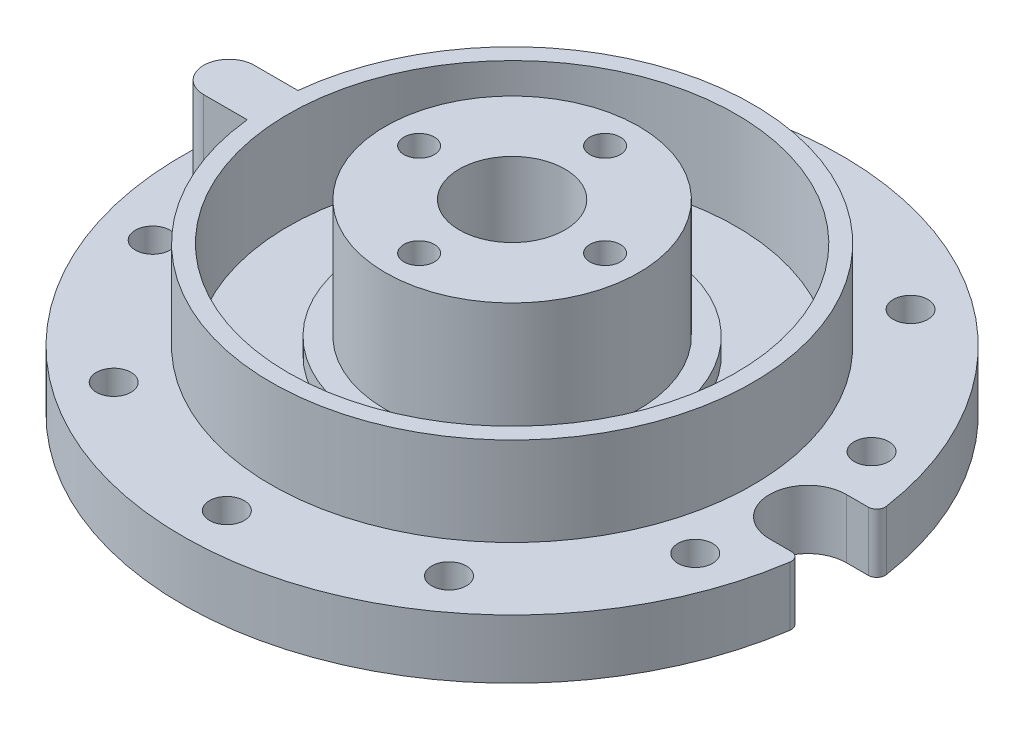
ISO-10303-21;
HEADER;
FILE_DESCRIPTION(('STEP AP214'),'2;1');
FILE_NAME('part.step','',(''),(''),'','','');
FILE_SCHEMA(('AUTOMOTIVE_DESIGN { 1 0 10303 214 1 1 1 1 }'));
ENDSEC;
DATA;
#1=APPLICATION_CONTEXT('core data for automotive mechanical design processes');
#2=APPLICATION_PROTOCOL_DEFINITION('international standard','automotive_design',2000,#1);
#3=PRODUCT_CONTEXT('',#1,'mechanical');
#4=PRODUCT('Part','Part','',(#3));
#5=PRODUCT_RELATED_PRODUCT_CATEGORY('part','',(#4));
#6=PRODUCT_DEFINITION_FORMATION('','',#4);
#7=PRODUCT_DEFINITION_CONTEXT('part definition',#1,'design');
#8=PRODUCT_DEFINITION('design','',#6,#7);
#9=PRODUCT_DEFINITION_SHAPE('','',#8);
#10=(LENGTH_UNIT() NAMED_UNIT(*) SI_UNIT(.MILLI.,.METRE.));
#11=(NAMED_UNIT(*) PLANE_ANGLE_UNIT() SI_UNIT($,.RADIAN.));
#12=(NAMED_UNIT(*) SI_UNIT($,.STERADIAN.) SOLID_ANGLE_UNIT());
#13=UNCERTAINTY_MEASURE_WITH_UNIT(LENGTH_MEASURE(1.E-05),#10,'distance_accuracy_value','');
#14=(GEOMETRIC_REPRESENTATION_CONTEXT(3) GLOBAL_UNCERTAINTY_ASSIGNED_CONTEXT((#13)) GLOBAL_UNIT_ASSIGNED_CONTEXT((#10,
#11,#12)) REPRESENTATION_CONTEXT('',''));
#15=CARTESIAN_POINT('',(0.,0.,0.));
#16=DIRECTION('',(0.,0.,1.));
#17=DIRECTION('',(1.,0.,0.));
#18=AXIS2_PLACEMENT_3D('',#15,#16,#17);
#19=CARTESIAN_POINT('',(0.,7.,0.));
#20=DIRECTION('',(0.,1.,0.));
#21=DIRECTION('',(0.,0.,1.));
#22=AXIS2_PLACEMENT_3D('',#19,#20,#21);
#23=PLANE('',#22);
#24=CARTESIAN_POINT('',(0.,7.,-33.75));
#25=DIRECTION('',(0.,1.,0.));
#26=DIRECTION('',(0.,0.,1.));
#27=AXIS2_PLACEMENT_3D('',#24,#25,#26);
#28=CIRCLE('',#27,2.05);
#29=CARTESIAN_POINT('',(0.,7.,-31.7));
#30=VERTEX_POINT('',#29);
#31=EDGE_CURVE('E168',#30,#30,#28,.T.);
#32=ORIENTED_EDGE('',*,*,#31,.F.);
#33=EDGE_LOOP('',(#32));
#34=FACE_BOUND('',#33,.T.);
#35=CARTESIAN_POINT('',(-19.8377522648707,7.,-27.3043235601536));
#36=DIRECTION('',(0.,1.,0.));
#37=DIRECTION('',(0.,0.,1.));
#38=AXIS2_PLACEMENT_3D('',#35,#36,#37);
#39=CIRCLE('',#38,2.05000000000094);
#40=CARTESIAN_POINT('',(-19.8377522648707,7.,-25.2543235601527));
#41=VERTEX_POINT('',#40);
#42=EDGE_CURVE('E153',#41,#41,#39,.T.);
#43=ORIENTED_EDGE('',*,*,#42,.F.);
#44=EDGE_LOOP('',(#43));
#45=FACE_BOUND('',#44,.T.);
#46=CARTESIAN_POINT('',(-32.0981574249604,7.,-10.4293235601531));
#47=DIRECTION('',(0.,1.,0.));
#48=DIRECTION('',(0.,0.,1.));
#49=AXIS2_PLACEMENT_3D('',#46,#47,#48);
#50=CIRCLE('',#49,2.05000000000172);
#51=CARTESIAN_POINT('',(-32.0981574249604,7.,-8.37932356015139));
#52=VERTEX_POINT('',#51);
#53=EDGE_CURVE('E175',#52,#52,#50,.T.);
#54=ORIENTED_EDGE('',*,*,#53,.F.);
#55=EDGE_LOOP('',(#54));
#56=FACE_BOUND('',#55,.T.);
#57=CARTESIAN_POINT('',(-32.0981574249596,7.,10.4293235601558));
#58=DIRECTION('',(0.,1.,0.));
#59=DIRECTION('',(0.,0.,1.));
#60=AXIS2_PLACEMENT_3D('',#57,#58,#59);
#61=CIRCLE('',#60,2.0500000000025);
#62=CARTESIAN_POINT('',(-32.0981574249596,7.,12.4793235601583));
#63=VERTEX_POINT('',#62);
#64=EDGE_CURVE('E216',#63,#63,#61,.T.);
#65=ORIENTED_EDGE('',*,*,#64,.F.);
#66=EDGE_LOOP('',(#65));
#67=FACE_BOUND('',#66,.T.);
#68=CARTESIAN_POINT('',(-19.8377522648684,7.,27.3043235601553));
#69=DIRECTION('',(0.,1.,0.));
#70=DIRECTION('',(0.,0.,1.));
#71=AXIS2_PLACEMENT_3D('',#68,#69,#70);
#72=CIRCLE('',#71,2.050000000003);
#73=CARTESIAN_POINT('',(-19.8377522648684,7.,29.3543235601583));
#74=VERTEX_POINT('',#73);
#75=EDGE_CURVE('E210',#74,#74,#72,.T.);
#76=ORIENTED_EDGE('',*,*,#75,.F.);
#77=EDGE_LOOP('',(#76));
#78=FACE_BOUND('',#77,.T.);
#79=CARTESIAN_POINT('',(2.86529853098704E-12,7.,33.75));
#80=DIRECTION('',(0.,1.,0.));
#81=DIRECTION('',(0.,0.,1.));
#82=AXIS2_PLACEMENT_3D('',#79,#80,#81);
#83=CIRCLE('',#82,2.05000000000297);
#84=CARTESIAN_POINT('',(2.86529853098704E-12,7.,35.800000000003));
#85=VERTEX_POINT('',#84);
#86=EDGE_CURVE('E204',#85,#85,#83,.T.);
#87=ORIENTED_EDGE('',*,*,#86,.F.);
#88=EDGE_LOOP('',(#87));
#89=FACE_BOUND('',#88,.T.);
#90=CARTESIAN_POINT('',(19.8377522648736,7.,27.3043235601536));
#91=DIRECTION('',(0.,1.,0.));
#92=DIRECTION('',(0.,0.,1.));
#93=AXIS2_PLACEMENT_3D('',#90,#91,#92);
#94=CIRCLE('',#93,2.05000000000241);
#95=CARTESIAN_POINT('',(19.8377522648736,7.,29.354323560156));
#96=VERTEX_POINT('',#95);
#97=EDGE_CURVE('E198',#96,#96,#94,.T.);
#98=ORIENTED_EDGE('',*,*,#97,.F.);
#99=EDGE_LOOP('',(#98));
#100=FACE_BOUND('',#99,.T.);
#101=CARTESIAN_POINT('',(32.0981574249633,7.,10.4293235601531));
#102=DIRECTION('',(0.,1.,0.));
#103=DIRECTION('',(0.,0.,1.));
#104=AXIS2_PLACEMENT_3D('',#101,#102,#103);
#105=CIRCLE('',#104,2.05000000000154);
#106=CARTESIAN_POINT('',(32.0981574249633,7.,12.4793235601547));
#107=VERTEX_POINT('',#106);
#108=EDGE_CURVE('E192',#107,#107,#105,.T.);
#109=ORIENTED_EDGE('',*,*,#108,.F.);
#110=EDGE_LOOP('',(#109));
#111=FACE_BOUND('',#110,.T.);
#112=CARTESIAN_POINT('',(32.0981574249624,7.,-10.4293235601558));
#113=DIRECTION('',(0.,1.,0.));
#114=DIRECTION('',(0.,0.,1.));
#115=AXIS2_PLACEMENT_3D('',#112,#113,#114);
#116=CIRCLE('',#115,2.05000000000065);
#117=CARTESIAN_POINT('',(32.0981574249624,7.,-8.37932356015519));
#118=VERTEX_POINT('',#117);
#119=EDGE_CURVE('E186',#118,#118,#116,.T.);
#120=ORIENTED_EDGE('',*,*,#119,.F.);
#121=EDGE_LOOP('',(#120));
#122=FACE_BOUND('',#121,.T.);
#123=CARTESIAN_POINT('',(19.8377522648712,7.,-27.3043235601553));
#124=DIRECTION('',(0.,1.,0.));
#125=DIRECTION('',(0.,0.,1.));
#126=AXIS2_PLACEMENT_3D('',#123,#124,#125);
#127=CIRCLE('',#126,2.05000000000006);
#128=CARTESIAN_POINT('',(19.8377522648712,7.,-25.2543235601553));
#129=VERTEX_POINT('',#128);
#130=EDGE_CURVE('E180',#129,#129,#127,.T.);
#131=ORIENTED_EDGE('',*,*,#130,.F.);
#132=EDGE_LOOP('',(#131));
#133=FACE_BOUND('',#132,.T.);
#134=CARTESIAN_POINT('',(0.,7.,0.));
#135=DIRECTION('',(0.,1.,0.));
#136=DIRECTION('',(0.,0.,1.));
#137=AXIS2_PLACEMENT_3D('',#134,#135,#136);
#138=CIRCLE('',#137,28.5);
#139=CARTESIAN_POINT('',(-28.3416654415368,7.,2.99999999999999));
#140=VERTEX_POINT('',#139);
#141=CARTESIAN_POINT('',(-28.3416654415368,7.,-3.));
#142=VERTEX_POINT('',#141);
#143=EDGE_CURVE('E232',#140,#142,#138,.T.);
#144=ORIENTED_EDGE('',*,*,#143,.F.);
#145=DIRECTION('',(1.,0.,0.));
#146=VECTOR('',#145,1.);
#147=CARTESIAN_POINT('',(-33.5,7.,3.));
#148=LINE('',#147,#146);
#149=CARTESIAN_POINT('',(-33.5,7.,3.));
#150=VERTEX_POINT('',#149);
#151=EDGE_CURVE('E144',#150,#140,#148,.T.);
#152=ORIENTED_EDGE('',*,*,#151,.F.);
#153=CARTESIAN_POINT('',(-33.5,7.,0.));
#154=DIRECTION('',(0.,1.,0.));
#155=DIRECTION('',(0.,0.,1.));
#156=AXIS2_PLACEMENT_3D('',#153,#154,#155);
#157=CIRCLE('',#156,3.);
#158=CARTESIAN_POINT('',(-33.5,7.,-3.));
#159=VERTEX_POINT('',#158);
#160=EDGE_CURVE('E148',#159,#150,#157,.T.);
#161=ORIENTED_EDGE('',*,*,#160,.F.);
#162=DIRECTION('',(-1.,0.,0.));
#163=VECTOR('',#162,1.);
#164=CARTESIAN_POINT('',(-33.5,7.,-3.));
#165=LINE('',#164,#163);
#166=EDGE_CURVE('E139',#142,#159,#165,.T.);
#167=ORIENTED_EDGE('',*,*,#166,.F.);
#168=EDGE_LOOP('',(#144,#152,#161,#167));
#169=FACE_BOUND('',#168,.T.);
#170=CARTESIAN_POINT('',(0.,7.,0.));
#171=DIRECTION('',(0.,1.,0.));
#172=DIRECTION('',(0.,0.,1.));
#173=AXIS2_PLACEMENT_3D('',#170,#171,#172);
#174=CIRCLE('',#173,39.);
#175=CARTESIAN_POINT('',(38.5817960237504,7.,-5.69605263157895));
#176=VERTEX_POINT('',#175);
#177=CARTESIAN_POINT('',(38.5817960237504,7.,5.69605263157895));
#178=VERTEX_POINT('',#177);
#179=EDGE_CURVE('E282',#176,#178,#174,.T.);
#180=ORIENTED_EDGE('',*,*,#179,.T.);
#181=CARTESIAN_POINT('',(37.5925192026286,7.,5.55));
#182=DIRECTION('',(0.,1.,0.));
#183=DIRECTION('',(0.,0.,1.));
#184=AXIS2_PLACEMENT_3D('',#181,#182,#183);
#185=CIRCLE('',#184,1.);
#186=CARTESIAN_POINT('',(37.5925192026286,7.,4.55));
#187=VERTEX_POINT('',#186);
#188=EDGE_CURVE('E302',#178,#187,#185,.T.);
#189=ORIENTED_EDGE('',*,*,#188,.T.);
#190=DIRECTION('',(1.,0.,0.));
#191=VECTOR('',#190,1.);
#192=CARTESIAN_POINT('',(35.,7.,4.55));
#193=LINE('',#192,#191);
#194=CARTESIAN_POINT('',(35.,7.,4.55));
#195=VERTEX_POINT('',#194);
#196=EDGE_CURVE('E131',#195,#187,#193,.T.);
#197=ORIENTED_EDGE('',*,*,#196,.F.);
#198=CARTESIAN_POINT('',(35.,7.,0.));
#199=DIRECTION('',(0.,1.,0.));
#200=DIRECTION('',(0.,0.,1.));
#201=AXIS2_PLACEMENT_3D('',#198,#199,#200);
#202=CIRCLE('',#201,4.55);
#203=CARTESIAN_POINT('',(35.,7.,-4.55));
#204=VERTEX_POINT('',#203);
#205=EDGE_CURVE('E118',#204,#195,#202,.T.);
#206=ORIENTED_EDGE('',*,*,#205,.F.);
#207=DIRECTION('',(1.,0.,0.));
#208=VECTOR('',#207,1.);
#209=CARTESIAN_POINT('',(35.,7.,-4.55));
#210=LINE('',#209,#208);
#211=CARTESIAN_POINT('',(37.5925192026286,7.,-4.55));
#212=VERTEX_POINT('',#211);
#213=EDGE_CURVE('E128',#204,#212,#210,.T.);
#214=ORIENTED_EDGE('',*,*,#213,.T.);
#215=CARTESIAN_POINT('',(37.5925192026286,7.,-5.55));
#216=DIRECTION('',(0.,1.,0.));
#217=DIRECTION('',(0.,0.,1.));
#218=AXIS2_PLACEMENT_3D('',#215,#216,#217);
#219=CIRCLE('',#218,1.);
#220=EDGE_CURVE('E300',#212,#176,#219,.T.);
#221=ORIENTED_EDGE('',*,*,#220,.T.);
#222=EDGE_LOOP('',(#180,#189,#197,#206,#214,#221));
#223=FACE_BOUND('',#222,.T.);
#224=ADVANCED_FACE('F32',(#34,#45,#56,#67,#78,#89,#100,#111,#122,#133,#169,#223),#23,.T.);
#225=CARTESIAN_POINT('',(0.,0.,0.));
#226=DIRECTION('',(0.,1.,0.));
#227=DIRECTION('',(0.,0.,1.));
#228=AXIS2_PLACEMENT_3D('',#225,#226,#227);
#229=PLANE('',#228);
#230=CARTESIAN_POINT('',(3.08597469297258E-13,0.,11.));
#231=DIRECTION('',(0.,-1.,0.));
#232=DIRECTION('',(0.,0.,-1.));
#233=AXIS2_PLACEMENT_3D('',#230,#231,#232);
#234=CIRCLE('',#233,4.55);
#235=CARTESIAN_POINT('',(3.08597469297258E-13,0.,6.45));
#236=VERTEX_POINT('',#235);
#237=EDGE_CURVE('E252',#236,#236,#234,.T.);
#238=ORIENTED_EDGE('',*,*,#237,.F.);
#239=EDGE_LOOP('',(#238));
#240=FACE_BOUND('',#239,.T.);
#241=CARTESIAN_POINT('',(0.,0.,0.));
#242=DIRECTION('',(0.,1.,0.));
#243=DIRECTION('',(0.,0.,1.));
#244=AXIS2_PLACEMENT_3D('',#241,#242,#243);
#245=CIRCLE('',#244,6.25);
#246=CARTESIAN_POINT('',(0.,0.,6.25));
#247=VERTEX_POINT('',#246);
#248=EDGE_CURVE('E269',#247,#247,#245,.T.);
#249=ORIENTED_EDGE('',*,*,#248,.T.);
#250=EDGE_LOOP('',(#249));
#251=FACE_BOUND('',#250,.T.);
#252=CARTESIAN_POINT('',(-10.9999999999998,0.,1.55645846127691E-13));
#253=DIRECTION('',(0.,-1.,0.));
#254=DIRECTION('',(0.,0.,-1.));
#255=AXIS2_PLACEMENT_3D('',#252,#253,#254);
#256=CIRCLE('',#255,4.55);
#257=CARTESIAN_POINT('',(-10.9999999999998,0.,-4.54999999999985));
#258=VERTEX_POINT('',#257);
#259=EDGE_CURVE('E248',#258,#258,#256,.T.);
#260=ORIENTED_EDGE('',*,*,#259,.F.);
#261=EDGE_LOOP('',(#260));
#262=FACE_BOUND('',#261,.T.);
#263=CARTESIAN_POINT('',(0.,0.,-11.));
#264=DIRECTION('',(0.,-1.,0.));
#265=DIRECTION('',(0.,0.,-1.));
#266=AXIS2_PLACEMENT_3D('',#263,#264,#265);
#267=CIRCLE('',#266,4.55);
#268=CARTESIAN_POINT('',(0.,0.,-15.55));
#269=VERTEX_POINT('',#268);
#270=EDGE_CURVE('E242',#269,#269,#267,.T.);
#271=ORIENTED_EDGE('',*,*,#270,.F.);
#272=EDGE_LOOP('',(#271));
#273=FACE_BOUND('',#272,.T.);
#274=CARTESIAN_POINT('',(11.,0.,0.));
#275=DIRECTION('',(0.,-1.,0.));
#276=DIRECTION('',(0.,0.,-1.));
#277=AXIS2_PLACEMENT_3D('',#274,#275,#276);
#278=CIRCLE('',#277,4.55);
#279=CARTESIAN_POINT('',(11.,0.,-4.54999999999996));
#280=VERTEX_POINT('',#279);
#281=EDGE_CURVE('E236',#280,#280,#278,.T.);
#282=ORIENTED_EDGE('',*,*,#281,.F.);
#283=EDGE_LOOP('',(#282));
#284=FACE_BOUND('',#283,.T.);
#285=CARTESIAN_POINT('',(19.8377522648712,0.,-27.3043235601553));
#286=DIRECTION('',(0.,1.,0.));
#287=DIRECTION('',(0.,0.,1.));
#288=AXIS2_PLACEMENT_3D('',#285,#286,#287);
#289=CIRCLE('',#288,2.05000000000006);
#290=CARTESIAN_POINT('',(19.8377522648712,0.,-25.2543235601553));
#291=VERTEX_POINT('',#290);
#292=EDGE_CURVE('E171',#291,#291,#289,.T.);
#293=ORIENTED_EDGE('',*,*,#292,.T.);
#294=EDGE_LOOP('',(#293));
#295=FACE_BOUND('',#294,.T.);
#296=CARTESIAN_POINT('',(32.0981574249624,0.,-10.4293235601558));
#297=DIRECTION('',(0.,1.,0.));
#298=DIRECTION('',(0.,0.,1.));
#299=AXIS2_PLACEMENT_3D('',#296,#297,#298);
#300=CIRCLE('',#299,2.05000000000065);
#301=CARTESIAN_POINT('',(32.0981574249624,0.,-8.37932356015519));
#302=VERTEX_POINT('',#301);
#303=EDGE_CURVE('E183',#302,#302,#300,.T.);
#304=ORIENTED_EDGE('',*,*,#303,.T.);
#305=EDGE_LOOP('',(#304));
#306=FACE_BOUND('',#305,.T.);
#307=CARTESIAN_POINT('',(32.0981574249633,0.,10.4293235601531));
#308=DIRECTION('',(0.,1.,0.));
#309=DIRECTION('',(0.,0.,1.));
#310=AXIS2_PLACEMENT_3D('',#307,#308,#309);
#311=CIRCLE('',#310,2.05000000000154);
#312=CARTESIAN_POINT('',(32.0981574249633,0.,12.4793235601547));
#313=VERTEX_POINT('',#312);
#314=EDGE_CURVE('E189',#313,#313,#311,.T.);
#315=ORIENTED_EDGE('',*,*,#314,.T.);
#316=EDGE_LOOP('',(#315));
#317=FACE_BOUND('',#316,.T.);
#318=CARTESIAN_POINT('',(19.8377522648736,0.,27.3043235601536));
#319=DIRECTION('',(0.,1.,0.));
#320=DIRECTION('',(0.,0.,1.));
#321=AXIS2_PLACEMENT_3D('',#318,#319,#320);
#322=CIRCLE('',#321,2.05000000000241);
#323=CARTESIAN_POINT('',(19.8377522648736,0.,29.354323560156));
#324=VERTEX_POINT('',#323);
#325=EDGE_CURVE('E195',#324,#324,#322,.T.);
#326=ORIENTED_EDGE('',*,*,#325,.T.);
#327=EDGE_LOOP('',(#326));
#328=FACE_BOUND('',#327,.T.);
#329=CARTESIAN_POINT('',(2.86529853098704E-12,0.,33.75));
#330=DIRECTION('',(0.,1.,0.));
#331=DIRECTION('',(0.,0.,1.));
#332=AXIS2_PLACEMENT_3D('',#329,#330,#331);
#333=CIRCLE('',#332,2.05000000000297);
#334=CARTESIAN_POINT('',(2.86529853098704E-12,0.,35.800000000003));
#335=VERTEX_POINT('',#334);
#336=EDGE_CURVE('E201',#335,#335,#333,.T.);
#337=ORIENTED_EDGE('',*,*,#336,.T.);
#338=EDGE_LOOP('',(#337));
#339=FACE_BOUND('',#338,.T.);
#340=CARTESIAN_POINT('',(-19.8377522648684,0.,27.3043235601553));
#341=DIRECTION('',(0.,1.,0.));
#342=DIRECTION('',(0.,0.,1.));
#343=AXIS2_PLACEMENT_3D('',#340,#341,#342);
#344=CIRCLE('',#343,2.050000000003);
#345=CARTESIAN_POINT('',(-19.8377522648684,0.,29.3543235601583));
#346=VERTEX_POINT('',#345);
#347=EDGE_CURVE('E207',#346,#346,#344,.T.);
#348=ORIENTED_EDGE('',*,*,#347,.T.);
#349=EDGE_LOOP('',(#348));
#350=FACE_BOUND('',#349,.T.);
#351=CARTESIAN_POINT('',(-32.0981574249596,0.,10.4293235601558));
#352=DIRECTION('',(0.,1.,0.));
#353=DIRECTION('',(0.,0.,1.));
#354=AXIS2_PLACEMENT_3D('',#351,#352,#353);
#355=CIRCLE('',#354,2.0500000000025);
#356=CARTESIAN_POINT('',(-32.0981574249596,0.,12.4793235601583));
#357=VERTEX_POINT('',#356);
#358=EDGE_CURVE('E213',#357,#357,#355,.T.);
#359=ORIENTED_EDGE('',*,*,#358,.T.);
#360=EDGE_LOOP('',(#359));
#361=FACE_BOUND('',#360,.T.);
#362=CARTESIAN_POINT('',(-32.0981574249604,0.,-10.4293235601531));
#363=DIRECTION('',(0.,1.,0.));
#364=DIRECTION('',(0.,0.,1.));
#365=AXIS2_PLACEMENT_3D('',#362,#363,#364);
#366=CIRCLE('',#365,2.05000000000172);
#367=CARTESIAN_POINT('',(-32.0981574249604,0.,-8.37932356015139));
#368=VERTEX_POINT('',#367);
#369=EDGE_CURVE('E219',#368,#368,#366,.T.);
#370=ORIENTED_EDGE('',*,*,#369,.T.);
#371=EDGE_LOOP('',(#370));
#372=FACE_BOUND('',#371,.T.);
#373=CARTESIAN_POINT('',(-19.8377522648707,0.,-27.3043235601536));
#374=DIRECTION('',(0.,1.,0.));
#375=DIRECTION('',(0.,0.,1.));
#376=AXIS2_PLACEMENT_3D('',#373,#374,#375);
#377=CIRCLE('',#376,2.05000000000094);
#378=CARTESIAN_POINT('',(-19.8377522648707,0.,-25.2543235601527));
#379=VERTEX_POINT('',#378);
#380=EDGE_CURVE('E172',#379,#379,#377,.T.);
#381=ORIENTED_EDGE('',*,*,#380,.T.);
#382=EDGE_LOOP('',(#381));
#383=FACE_BOUND('',#382,.T.);
#384=CARTESIAN_POINT('',(0.,0.,-33.75));
#385=DIRECTION('',(0.,1.,0.));
#386=DIRECTION('',(0.,0.,1.));
#387=AXIS2_PLACEMENT_3D('',#384,#385,#386);
#388=CIRCLE('',#387,2.05);
#389=CARTESIAN_POINT('',(0.,0.,-31.7));
#390=VERTEX_POINT('',#389);
#391=EDGE_CURVE('E164',#390,#390,#388,.T.);
#392=ORIENTED_EDGE('',*,*,#391,.T.);
#393=EDGE_LOOP('',(#392));
#394=FACE_BOUND('',#393,.T.);
#395=DIRECTION('',(1.,0.,0.));
#396=VECTOR('',#395,1.);
#397=CARTESIAN_POINT('',(35.,0.,4.55));
#398=LINE('',#397,#396);
#399=CARTESIAN_POINT('',(35.,0.,4.55));
#400=VERTEX_POINT('',#399);
#401=CARTESIAN_POINT('',(37.5925192026286,0.,4.55));
#402=VERTEX_POINT('',#401);
#403=EDGE_CURVE('E123',#400,#402,#398,.T.);
#404=ORIENTED_EDGE('',*,*,#403,.T.);
#405=CARTESIAN_POINT('',(37.5925192026286,0.,5.55));
#406=DIRECTION('',(0.,1.,0.));
#407=DIRECTION('',(0.,0.,1.));
#408=AXIS2_PLACEMENT_3D('',#405,#406,#407);
#409=CIRCLE('',#408,1.);
#410=CARTESIAN_POINT('',(38.5817960237504,0.,5.69605263157895));
#411=VERTEX_POINT('',#410);
#412=EDGE_CURVE('E40',#402,#411,#409,.F.);
#413=ORIENTED_EDGE('',*,*,#412,.T.);
#414=CARTESIAN_POINT('',(0.,0.,0.));
#415=DIRECTION('',(0.,1.,0.));
#416=DIRECTION('',(0.,0.,1.));
#417=AXIS2_PLACEMENT_3D('',#414,#415,#416);
#418=CIRCLE('',#417,39.);
#419=CARTESIAN_POINT('',(38.5817960237504,0.,-5.69605263157895));
#420=VERTEX_POINT('',#419);
#421=EDGE_CURVE('E285',#420,#411,#418,.T.);
#422=ORIENTED_EDGE('',*,*,#421,.F.);
#423=CARTESIAN_POINT('',(37.5925192026286,0.,-5.55));
#424=DIRECTION('',(0.,1.,0.));
#425=DIRECTION('',(0.,0.,1.));
#426=AXIS2_PLACEMENT_3D('',#423,#424,#425);
#427=CIRCLE('',#426,1.);
#428=CARTESIAN_POINT('',(37.5925192026286,0.,-4.55));
#429=VERTEX_POINT('',#428);
#430=EDGE_CURVE('E47',#420,#429,#427,.F.);
#431=ORIENTED_EDGE('',*,*,#430,.T.);
#432=DIRECTION('',(1.,0.,0.));
#433=VECTOR('',#432,1.);
#434=CARTESIAN_POINT('',(35.,0.,-4.55));
#435=LINE('',#434,#433);
#436=CARTESIAN_POINT('',(35.,0.,-4.55));
#437=VERTEX_POINT('',#436);
#438=EDGE_CURVE('E121',#437,#429,#435,.T.);
#439=ORIENTED_EDGE('',*,*,#438,.F.);
#440=CARTESIAN_POINT('',(35.,0.,0.));
#441=DIRECTION('',(0.,1.,0.));
#442=DIRECTION('',(0.,0.,1.));
#443=AXIS2_PLACEMENT_3D('',#440,#441,#442);
#444=CIRCLE('',#443,4.55);
#445=EDGE_CURVE('E116',#437,#400,#444,.T.);
#446=ORIENTED_EDGE('',*,*,#445,.T.);
#447=EDGE_LOOP('',(#404,#413,#422,#431,#439,#446));
#448=FACE_BOUND('',#447,.T.);
#449=ADVANCED_FACE('F127',(#240,#251,#262,#273,#284,#295,#306,#317,#328,#339,#350,#361,#372,
#383,#394,#448),#229,.F.);
#450=CARTESIAN_POINT('',(0.,7.,0.));
#451=DIRECTION('',(0.,-1.,0.));
#452=DIRECTION('',(0.,0.,-1.));
#453=AXIS2_PLACEMENT_3D('',#450,#451,#452);
#454=CYLINDRICAL_SURFACE('',#453,39.);
#455=ORIENTED_EDGE('',*,*,#421,.T.);
#456=DIRECTION('',(0.,-1.,0.));
#457=VECTOR('',#456,1.);
#458=CARTESIAN_POINT('',(38.5817960237504,7.,5.69605263157895));
#459=LINE('',#458,#457);
#460=EDGE_CURVE('E297',#411,#178,#459,.F.);
#461=ORIENTED_EDGE('',*,*,#460,.T.);
#462=ORIENTED_EDGE('',*,*,#179,.F.);
#463=DIRECTION('',(0.,-1.,0.));
#464=VECTOR('',#463,1.);
#465=CARTESIAN_POINT('',(38.5817960237504,7.,-5.69605263157895));
#466=LINE('',#465,#464);
#467=EDGE_CURVE('E281',#176,#420,#466,.T.);
#468=ORIENTED_EDGE('',*,*,#467,.T.);
#469=EDGE_LOOP('',(#455,#461,#462,#468));
#470=FACE_BOUND('',#469,.T.);
#471=ADVANCED_FACE('F308',(#470),#454,.T.);
#472=CARTESIAN_POINT('',(0.,17.5,0.));
#473=DIRECTION('',(0.,-1.,0.));
#474=DIRECTION('',(0.,0.,-1.));
#475=AXIS2_PLACEMENT_3D('',#472,#473,#474);
#476=CYLINDRICAL_SURFACE('',#475,28.5);
#477=DIRECTION('',(0.,-1.,0.));
#478=VECTOR('',#477,1.);
#479=CARTESIAN_POINT('',(-28.3416654415368,27.6271132494811,2.99999999999999));
#480=LINE('',#479,#478);
#481=CARTESIAN_POINT('',(-28.3416654415368,17.5,3.));
#482=VERTEX_POINT('',#481);
#483=EDGE_CURVE('E146',#482,#140,#480,.T.);
#484=ORIENTED_EDGE('',*,*,#483,.T.);
#485=ORIENTED_EDGE('',*,*,#143,.T.);
#486=DIRECTION('',(0.,-1.,0.));
#487=VECTOR('',#486,1.);
#488=CARTESIAN_POINT('',(-28.3416654415368,27.6271132494811,-3.));
#489=LINE('',#488,#487);
#490=CARTESIAN_POINT('',(-28.3416654415368,17.5,-3.));
#491=VERTEX_POINT('',#490);
#492=EDGE_CURVE('E143',#491,#142,#489,.T.);
#493=ORIENTED_EDGE('',*,*,#492,.F.);
#494=CARTESIAN_POINT('',(0.,17.5,0.));
#495=DIRECTION('',(0.,1.,0.));
#496=DIRECTION('',(0.,0.,1.));
#497=AXIS2_PLACEMENT_3D('',#494,#495,#496);
#498=CIRCLE('',#497,28.5);
#499=EDGE_CURVE('E233',#482,#491,#498,.T.);
#500=ORIENTED_EDGE('',*,*,#499,.F.);
#501=EDGE_LOOP('',(#484,#485,#493,#500));
#502=FACE_BOUND('',#501,.T.);
#503=ADVANCED_FACE('F342',(#502),#476,.T.);
#504=CARTESIAN_POINT('',(0.,8.,0.));
#505=DIRECTION('',(0.,-1.,0.));
#506=DIRECTION('',(0.,0.,-1.));
#507=AXIS2_PLACEMENT_3D('',#504,#505,#506);
#508=CYLINDRICAL_SURFACE('',#507,17.5);
#509=CARTESIAN_POINT('',(0.,8.,0.));
#510=DIRECTION('',(0.,1.,0.));
#511=DIRECTION('',(0.,0.,1.));
#512=AXIS2_PLACEMENT_3D('',#509,#510,#511);
#513=CIRCLE('',#512,17.5);
#514=CARTESIAN_POINT('',(0.,8.,17.5));
#515=VERTEX_POINT('',#514);
#516=EDGE_CURVE('E277',#515,#515,#513,.T.);
#517=ORIENTED_EDGE('',*,*,#516,.F.);
#518=EDGE_LOOP('',(#517));
#519=FACE_BOUND('',#518,.T.);
#520=CARTESIAN_POINT('',(0.,6.,0.));
#521=DIRECTION('',(0.,1.,0.));
#522=DIRECTION('',(0.,0.,1.));
#523=AXIS2_PLACEMENT_3D('',#520,#521,#522);
#524=CIRCLE('',#523,17.5);
#525=CARTESIAN_POINT('',(0.,6.,17.5));
#526=VERTEX_POINT('',#525);
#527=EDGE_CURVE('E167',#526,#526,#524,.T.);
#528=ORIENTED_EDGE('',*,*,#527,.T.);
#529=EDGE_LOOP('',(#528));
#530=FACE_BOUND('',#529,.T.);
#531=ADVANCED_FACE('F338',(#519,#530),#508,.T.);
#532=CARTESIAN_POINT('',(0.,8.,0.));
#533=DIRECTION('',(0.,1.,0.));
#534=DIRECTION('',(0.,0.,1.));
#535=AXIS2_PLACEMENT_3D('',#532,#533,#534);
#536=PLANE('',#535);
#537=CARTESIAN_POINT('',(0.,8.,0.));
#538=DIRECTION('',(0.,1.,0.));
#539=DIRECTION('',(0.,0.,1.));
#540=AXIS2_PLACEMENT_3D('',#537,#538,#539);
#541=CIRCLE('',#540,15.);
#542=CARTESIAN_POINT('',(0.,8.,15.));
#543=VERTEX_POINT('',#542);
#544=EDGE_CURVE('E278',#543,#543,#541,.T.);
#545=ORIENTED_EDGE('',*,*,#544,.F.);
#546=EDGE_LOOP('',(#545));
#547=FACE_BOUND('',#546,.T.);
#548=ORIENTED_EDGE('',*,*,#516,.T.);
#549=EDGE_LOOP('',(#548));
#550=FACE_BOUND('',#549,.T.);
#551=ADVANCED_FACE('F566',(#547,#550),#536,.T.);
#552=CARTESIAN_POINT('',(0.,22.,0.));
#553=DIRECTION('',(0.,-1.,0.));
#554=DIRECTION('',(0.,0.,-1.));
#555=AXIS2_PLACEMENT_3D('',#552,#553,#554);
#556=CYLINDRICAL_SURFACE('',#555,15.);
#557=CARTESIAN_POINT('',(0.,22.,0.));
#558=DIRECTION('',(0.,1.,0.));
#559=DIRECTION('',(0.,0.,1.));
#560=AXIS2_PLACEMENT_3D('',#557,#558,#559);
#561=CIRCLE('',#560,15.);
#562=CARTESIAN_POINT('',(0.,22.,15.));
#563=VERTEX_POINT('',#562);
#564=EDGE_CURVE('E272',#563,#563,#561,.T.);
#565=ORIENTED_EDGE('',*,*,#564,.F.);
#566=EDGE_LOOP('',(#565));
#567=FACE_BOUND('',#566,.T.);
#568=ORIENTED_EDGE('',*,*,#544,.T.);
#569=EDGE_LOOP('',(#568));
#570=FACE_BOUND('',#569,.T.);
#571=ADVANCED_FACE('F666',(#567,#570),#556,.T.);
#572=CARTESIAN_POINT('',(0.,22.,0.));
#573=DIRECTION('',(0.,1.,0.));
#574=DIRECTION('',(0.,0.,1.));
#575=AXIS2_PLACEMENT_3D('',#572,#573,#574);
#576=PLANE('',#575);
#577=CARTESIAN_POINT('',(0.,22.,-11.));
#578=DIRECTION('',(0.,1.,0.));
#579=DIRECTION('',(0.,0.,1.));
#580=AXIS2_PLACEMENT_3D('',#577,#578,#579);
#581=CIRCLE('',#580,1.8);
#582=CARTESIAN_POINT('',(0.,22.,-9.2));
#583=VERTEX_POINT('',#582);
#584=EDGE_CURVE('E263',#583,#583,#581,.T.);
#585=ORIENTED_EDGE('',*,*,#584,.F.);
#586=EDGE_LOOP('',(#585));
#587=FACE_BOUND('',#586,.T.);
#588=CARTESIAN_POINT('',(11.,22.,0.));
#589=DIRECTION('',(0.,1.,0.));
#590=DIRECTION('',(0.,0.,1.));
#591=AXIS2_PLACEMENT_3D('',#588,#589,#590);
#592=CIRCLE('',#591,1.8);
#593=CARTESIAN_POINT('',(11.,22.,1.80000000000004));
#594=VERTEX_POINT('',#593);
#595=EDGE_CURVE('E259',#594,#594,#592,.T.);
#596=ORIENTED_EDGE('',*,*,#595,.F.);
#597=EDGE_LOOP('',(#596));
#598=FACE_BOUND('',#597,.T.);
#599=CARTESIAN_POINT('',(3.08597469297258E-13,22.,11.));
#600=DIRECTION('',(0.,1.,0.));
#601=DIRECTION('',(0.,0.,1.));
#602=AXIS2_PLACEMENT_3D('',#599,#600,#601);
#603=CIRCLE('',#602,1.8);
#604=CARTESIAN_POINT('',(3.08597469297258E-13,22.,12.8));
#605=VERTEX_POINT('',#604);
#606=EDGE_CURVE('E256',#605,#605,#603,.T.);
#607=ORIENTED_EDGE('',*,*,#606,.F.);
#608=EDGE_LOOP('',(#607));
#609=FACE_BOUND('',#608,.T.);
#610=CARTESIAN_POINT('',(-10.9999999999998,22.,1.55645846127691E-13));
#611=DIRECTION('',(0.,1.,0.));
#612=DIRECTION('',(0.,0.,1.));
#613=AXIS2_PLACEMENT_3D('',#610,#611,#612);
#614=CIRCLE('',#613,1.8);
#615=CARTESIAN_POINT('',(-10.9999999999998,22.,1.80000000000015));
#616=VERTEX_POINT('',#615);
#617=EDGE_CURVE('E260',#616,#616,#614,.T.);
#618=ORIENTED_EDGE('',*,*,#617,.F.);
#619=EDGE_LOOP('',(#618));
#620=FACE_BOUND('',#619,.T.);
#621=CARTESIAN_POINT('',(0.,22.,0.));
#622=DIRECTION('',(0.,1.,0.));
#623=DIRECTION('',(0.,0.,1.));
#624=AXIS2_PLACEMENT_3D('',#621,#622,#623);
#625=CIRCLE('',#624,6.25);
#626=CARTESIAN_POINT('',(0.,22.,6.25));
#627=VERTEX_POINT('',#626);
#628=EDGE_CURVE('E266',#627,#627,#625,.T.);
#629=ORIENTED_EDGE('',*,*,#628,.F.);
#630=EDGE_LOOP('',(#629));
#631=FACE_BOUND('',#630,.T.);
#632=ORIENTED_EDGE('',*,*,#564,.T.);
#633=EDGE_LOOP('',(#632));
#634=FACE_BOUND('',#633,.T.);
#635=ADVANCED_FACE('F656',(#587,#598,#609,#620,#631,#634),#576,.T.);
#636=CARTESIAN_POINT('',(0.,0.,0.));
#637=DIRECTION('',(0.,1.,0.));
#638=DIRECTION('',(0.,0.,1.));
#639=AXIS2_PLACEMENT_3D('',#636,#637,#638);
#640=CYLINDRICAL_SURFACE('',#639,6.25);
#641=ORIENTED_EDGE('',*,*,#248,.F.);
#642=EDGE_LOOP('',(#641));
#643=FACE_BOUND('',#642,.T.);
#644=ORIENTED_EDGE('',*,*,#628,.T.);
#645=EDGE_LOOP('',(#644));
#646=FACE_BOUND('',#645,.T.);
#647=ADVANCED_FACE('F646',(#643,#646),#640,.F.);
#648=CARTESIAN_POINT('',(-10.9999999999998,0.,1.55645846127691E-13));
#649=DIRECTION('',(0.,1.,0.));
#650=DIRECTION('',(0.,0.,1.));
#651=AXIS2_PLACEMENT_3D('',#648,#649,#650);
#652=CYLINDRICAL_SURFACE('',#651,1.8);
#653=CARTESIAN_POINT('',(-10.9999999999998,2.74999999999999,1.55645846127691E-13));
#654=DIRECTION('',(0.,-1.,0.));
#655=DIRECTION('',(0.,0.,-1.));
#656=AXIS2_PLACEMENT_3D('',#653,#654,#655);
#657=CIRCLE('',#656,1.8);
#658=CARTESIAN_POINT('',(-10.9999999999998,2.74999999999999,-1.79999999999984));
#659=VERTEX_POINT('',#658);
#660=EDGE_CURVE('E251',#659,#659,#657,.T.);
#661=ORIENTED_EDGE('',*,*,#660,.T.);
#662=EDGE_LOOP('',(#661));
#663=FACE_BOUND('',#662,.T.);
#664=ORIENTED_EDGE('',*,*,#617,.T.);
#665=EDGE_LOOP('',(#664));
#666=FACE_BOUND('',#665,.T.);
#667=ADVANCED_FACE('F636',(#663,#666),#652,.F.);
#668=CARTESIAN_POINT('',(3.08597469297258E-13,0.,11.));
#669=DIRECTION('',(0.,1.,0.));
#670=DIRECTION('',(0.,0.,1.));
#671=AXIS2_PLACEMENT_3D('',#668,#669,#670);
#672=CYLINDRICAL_SURFACE('',#671,1.8);
#673=CARTESIAN_POINT('',(3.08597469297258E-13,2.74999999999998,11.));
#674=DIRECTION('',(0.,-1.,0.));
#675=DIRECTION('',(0.,0.,-1.));
#676=AXIS2_PLACEMENT_3D('',#673,#674,#675);
#677=CIRCLE('',#676,1.8);
#678=CARTESIAN_POINT('',(3.08597469297258E-13,2.74999999999998,9.2));
#679=VERTEX_POINT('',#678);
#680=EDGE_CURVE('E255',#679,#679,#677,.T.);
#681=ORIENTED_EDGE('',*,*,#680,.T.);
#682=EDGE_LOOP('',(#681));
#683=FACE_BOUND('',#682,.T.);
#684=ORIENTED_EDGE('',*,*,#606,.T.);
#685=EDGE_LOOP('',(#684));
#686=FACE_BOUND('',#685,.T.);
#687=ADVANCED_FACE('F626',(#683,#686),#672,.F.);
#688=CARTESIAN_POINT('',(11.,0.,0.));
#689=DIRECTION('',(0.,1.,0.));
#690=DIRECTION('',(0.,0.,1.));
#691=AXIS2_PLACEMENT_3D('',#688,#689,#690);
#692=CYLINDRICAL_SURFACE('',#691,1.8);
#693=CARTESIAN_POINT('',(11.,2.74999999999999,0.));
#694=DIRECTION('',(0.,-1.,0.));
#695=DIRECTION('',(0.,0.,-1.));
#696=AXIS2_PLACEMENT_3D('',#693,#694,#695);
#697=CIRCLE('',#696,1.8);
#698=CARTESIAN_POINT('',(11.,2.74999999999999,-1.79999999999996));
#699=VERTEX_POINT('',#698);
#700=EDGE_CURVE('E241',#699,#699,#697,.T.);
#701=ORIENTED_EDGE('',*,*,#700,.T.);
#702=EDGE_LOOP('',(#701));
#703=FACE_BOUND('',#702,.T.);
#704=ORIENTED_EDGE('',*,*,#595,.T.);
#705=EDGE_LOOP('',(#704));
#706=FACE_BOUND('',#705,.T.);
#707=ADVANCED_FACE('F616',(#703,#706),#692,.F.);
#708=CARTESIAN_POINT('',(0.,0.,-11.));
#709=DIRECTION('',(0.,1.,0.));
#710=DIRECTION('',(0.,0.,1.));
#711=AXIS2_PLACEMENT_3D('',#708,#709,#710);
#712=CYLINDRICAL_SURFACE('',#711,1.8);
#713=CARTESIAN_POINT('',(0.,2.74999999999998,-11.));
#714=DIRECTION('',(0.,-1.,0.));
#715=DIRECTION('',(0.,0.,-1.));
#716=AXIS2_PLACEMENT_3D('',#713,#714,#715);
#717=CIRCLE('',#716,1.8);
#718=CARTESIAN_POINT('',(0.,2.74999999999998,-12.8));
#719=VERTEX_POINT('',#718);
#720=EDGE_CURVE('E245',#719,#719,#717,.T.);
#721=ORIENTED_EDGE('',*,*,#720,.T.);
#722=EDGE_LOOP('',(#721));
#723=FACE_BOUND('',#722,.T.);
#724=ORIENTED_EDGE('',*,*,#584,.T.);
#725=EDGE_LOOP('',(#724));
#726=FACE_BOUND('',#725,.T.);
#727=ADVANCED_FACE('F606',(#723,#726),#712,.F.);
#728=CARTESIAN_POINT('',(3.08597469297258E-13,0.,11.));
#729=DIRECTION('',(0.,-1.,0.));
#730=DIRECTION('',(0.,0.,-1.));
#731=AXIS2_PLACEMENT_3D('',#728,#729,#730);
#732=CONICAL_SURFACE('',#731,4.55,0.785398163397451);
#733=ORIENTED_EDGE('',*,*,#237,.T.);
#734=EDGE_LOOP('',(#733));
#735=FACE_BOUND('',#734,.T.);
#736=ORIENTED_EDGE('',*,*,#680,.F.);
#737=EDGE_LOOP('',(#736));
#738=FACE_BOUND('',#737,.T.);
#739=ADVANCED_FACE('F596',(#735,#738),#732,.F.);
#740=CARTESIAN_POINT('',(-10.9999999999998,0.,1.55645846127691E-13));
#741=DIRECTION('',(0.,-1.,0.));
#742=DIRECTION('',(0.,0.,-1.));
#743=AXIS2_PLACEMENT_3D('',#740,#741,#742);
#744=CONICAL_SURFACE('',#743,4.55,0.785398163397451);
#745=ORIENTED_EDGE('',*,*,#259,.T.);
#746=EDGE_LOOP('',(#745));
#747=FACE_BOUND('',#746,.T.);
#748=ORIENTED_EDGE('',*,*,#660,.F.);
#749=EDGE_LOOP('',(#748));
#750=FACE_BOUND('',#749,.T.);
#751=ADVANCED_FACE('F586',(#747,#750),#744,.F.);
#752=CARTESIAN_POINT('',(0.,0.,-11.));
#753=DIRECTION('',(0.,-1.,0.));
#754=DIRECTION('',(0.,0.,-1.));
#755=AXIS2_PLACEMENT_3D('',#752,#753,#754);
#756=CONICAL_SURFACE('',#755,4.55,0.785398163397451);
#757=ORIENTED_EDGE('',*,*,#270,.T.);
#758=EDGE_LOOP('',(#757));
#759=FACE_BOUND('',#758,.T.);
#760=ORIENTED_EDGE('',*,*,#720,.F.);
#761=EDGE_LOOP('',(#760));
#762=FACE_BOUND('',#761,.T.);
#763=ADVANCED_FACE('F576',(#759,#762),#756,.F.);
#764=CARTESIAN_POINT('',(11.,0.,0.));
#765=DIRECTION('',(0.,-1.,0.));
#766=DIRECTION('',(0.,0.,-1.));
#767=AXIS2_PLACEMENT_3D('',#764,#765,#766);
#768=CONICAL_SURFACE('',#767,4.55,0.785398163397451);
#769=ORIENTED_EDGE('',*,*,#281,.T.);
#770=EDGE_LOOP('',(#769));
#771=FACE_BOUND('',#770,.T.);
#772=ORIENTED_EDGE('',*,*,#700,.F.);
#773=EDGE_LOOP('',(#772));
#774=FACE_BOUND('',#773,.T.);
#775=ADVANCED_FACE('F428',(#771,#774),#768,.F.);
#776=CARTESIAN_POINT('',(0.,17.5,0.));
#777=DIRECTION('',(0.,1.,0.));
#778=DIRECTION('',(0.,0.,1.));
#779=AXIS2_PLACEMENT_3D('',#776,#777,#778);
#780=PLANE('',#779);
#781=ORIENTED_EDGE('',*,*,#499,.T.);
#782=DIRECTION('',(-1.,0.,0.));
#783=VECTOR('',#782,1.);
#784=CARTESIAN_POINT('',(-33.5,17.5,-3.));
#785=LINE('',#784,#783);
#786=CARTESIAN_POINT('',(-33.5,17.5,-3.));
#787=VERTEX_POINT('',#786);
#788=EDGE_CURVE('E142',#491,#787,#785,.T.);
#789=ORIENTED_EDGE('',*,*,#788,.T.);
#790=CARTESIAN_POINT('',(-33.5,17.5,0.));
#791=DIRECTION('',(0.,1.,0.));
#792=DIRECTION('',(0.,0.,1.));
#793=AXIS2_PLACEMENT_3D('',#790,#791,#792);
#794=CIRCLE('',#793,3.);
#795=CARTESIAN_POINT('',(-33.5,17.5,3.));
#796=VERTEX_POINT('',#795);
#797=EDGE_CURVE('E154',#787,#796,#794,.T.);
#798=ORIENTED_EDGE('',*,*,#797,.T.);
#799=DIRECTION('',(1.,0.,0.));
#800=VECTOR('',#799,1.);
#801=CARTESIAN_POINT('',(-33.5,17.5,3.));
#802=LINE('',#801,#800);
#803=EDGE_CURVE('E151',#796,#482,#802,.T.);
#804=ORIENTED_EDGE('',*,*,#803,.T.);
#805=EDGE_LOOP('',(#781,#789,#798,#804));
#806=FACE_BOUND('',#805,.T.);
#807=CARTESIAN_POINT('',(0.,17.5,0.));
#808=DIRECTION('',(0.,1.,0.));
#809=DIRECTION('',(0.,0.,1.));
#810=AXIS2_PLACEMENT_3D('',#807,#808,#809);
#811=CIRCLE('',#810,26.5);
#812=CARTESIAN_POINT('',(0.,17.5,26.5));
#813=VERTEX_POINT('',#812);
#814=EDGE_CURVE('E229',#813,#813,#811,.T.);
#815=ORIENTED_EDGE('',*,*,#814,.F.);
#816=EDGE_LOOP('',(#815));
#817=FACE_BOUND('',#816,.T.);
#818=ADVANCED_FACE('F423',(#806,#817),#780,.T.);
#819=CARTESIAN_POINT('',(0.,17.5,0.));
#820=DIRECTION('',(0.,-1.,0.));
#821=DIRECTION('',(0.,0.,-1.));
#822=AXIS2_PLACEMENT_3D('',#819,#820,#821);
#823=CYLINDRICAL_SURFACE('',#822,26.5);
#824=ORIENTED_EDGE('',*,*,#814,.T.);
#825=EDGE_LOOP('',(#824));
#826=FACE_BOUND('',#825,.T.);
#827=CARTESIAN_POINT('',(0.,6.,0.));
#828=DIRECTION('',(0.,1.,0.));
#829=DIRECTION('',(0.,0.,1.));
#830=AXIS2_PLACEMENT_3D('',#827,#828,#829);
#831=CIRCLE('',#830,26.5);
#832=CARTESIAN_POINT('',(0.,6.,26.5));
#833=VERTEX_POINT('',#832);
#834=EDGE_CURVE('E226',#833,#833,#831,.T.);
#835=ORIENTED_EDGE('',*,*,#834,.F.);
#836=EDGE_LOOP('',(#835));
#837=FACE_BOUND('',#836,.T.);
#838=ADVANCED_FACE('F427',(#826,#837),#823,.F.);
#839=CARTESIAN_POINT('',(0.,6.,0.));
#840=DIRECTION('',(0.,1.,0.));
#841=DIRECTION('',(0.,0.,1.));
#842=AXIS2_PLACEMENT_3D('',#839,#840,#841);
#843=PLANE('',#842);
#844=ORIENTED_EDGE('',*,*,#527,.F.);
#845=EDGE_LOOP('',(#844));
#846=FACE_BOUND('',#845,.T.);
#847=ORIENTED_EDGE('',*,*,#834,.T.);
#848=EDGE_LOOP('',(#847));
#849=FACE_BOUND('',#848,.T.);
#850=ADVANCED_FACE('F539',(#846,#849),#843,.T.);
#851=CARTESIAN_POINT('',(19.8377522648712,0.,-27.3043235601553));
#852=DIRECTION('',(0.,1.,0.));
#853=DIRECTION('',(0.,0.,1.));
#854=AXIS2_PLACEMENT_3D('',#851,#852,#853);
#855=CYLINDRICAL_SURFACE('',#854,2.05000000000006);
#856=ORIENTED_EDGE('',*,*,#292,.F.);
#857=EDGE_LOOP('',(#856));
#858=FACE_BOUND('',#857,.T.);
#859=ORIENTED_EDGE('',*,*,#130,.T.);
#860=EDGE_LOOP('',(#859));
#861=FACE_BOUND('',#860,.T.);
#862=ADVANCED_FACE('F529',(#858,#861),#855,.F.);
#863=CARTESIAN_POINT('',(32.0981574249624,0.,-10.4293235601558));
#864=DIRECTION('',(0.,1.,0.));
#865=DIRECTION('',(0.,0.,1.));
#866=AXIS2_PLACEMENT_3D('',#863,#864,#865);
#867=CYLINDRICAL_SURFACE('',#866,2.05000000000065);
#868=ORIENTED_EDGE('',*,*,#303,.F.);
#869=EDGE_LOOP('',(#868));
#870=FACE_BOUND('',#869,.T.);
#871=ORIENTED_EDGE('',*,*,#119,.T.);
#872=EDGE_LOOP('',(#871));
#873=FACE_BOUND('',#872,.T.);
#874=ADVANCED_FACE('F519',(#870,#873),#867,.F.);
#875=CARTESIAN_POINT('',(32.0981574249633,0.,10.4293235601531));
#876=DIRECTION('',(0.,1.,0.));
#877=DIRECTION('',(0.,0.,1.));
#878=AXIS2_PLACEMENT_3D('',#875,#876,#877);
#879=CYLINDRICAL_SURFACE('',#878,2.05000000000154);
#880=ORIENTED_EDGE('',*,*,#314,.F.);
#881=EDGE_LOOP('',(#880));
#882=FACE_BOUND('',#881,.T.);
#883=ORIENTED_EDGE('',*,*,#108,.T.);
#884=EDGE_LOOP('',(#883));
#885=FACE_BOUND('',#884,.T.);
#886=ADVANCED_FACE('F509',(#882,#885),#879,.F.);
#887=CARTESIAN_POINT('',(19.8377522648736,0.,27.3043235601536));
#888=DIRECTION('',(0.,1.,0.));
#889=DIRECTION('',(0.,0.,1.));
#890=AXIS2_PLACEMENT_3D('',#887,#888,#889);
#891=CYLINDRICAL_SURFACE('',#890,2.05000000000241);
#892=ORIENTED_EDGE('',*,*,#325,.F.);
#893=EDGE_LOOP('',(#892));
#894=FACE_BOUND('',#893,.T.);
#895=ORIENTED_EDGE('',*,*,#97,.T.);
#896=EDGE_LOOP('',(#895));
#897=FACE_BOUND('',#896,.T.);
#898=ADVANCED_FACE('F499',(#894,#897),#891,.F.);
#899=CARTESIAN_POINT('',(2.86529853098704E-12,0.,33.75));
#900=DIRECTION('',(0.,1.,0.));
#901=DIRECTION('',(0.,0.,1.));
#902=AXIS2_PLACEMENT_3D('',#899,#900,#901);
#903=CYLINDRICAL_SURFACE('',#902,2.05000000000297);
#904=ORIENTED_EDGE('',*,*,#336,.F.);
#905=EDGE_LOOP('',(#904));
#906=FACE_BOUND('',#905,.T.);
#907=ORIENTED_EDGE('',*,*,#86,.T.);
#908=EDGE_LOOP('',(#907));
#909=FACE_BOUND('',#908,.T.);
#910=ADVANCED_FACE('F489',(#906,#909),#903,.F.);
#911=CARTESIAN_POINT('',(-19.8377522648684,0.,27.3043235601553));
#912=DIRECTION('',(0.,1.,0.));
#913=DIRECTION('',(0.,0.,1.));
#914=AXIS2_PLACEMENT_3D('',#911,#912,#913);
#915=CYLINDRICAL_SURFACE('',#914,2.050000000003);
#916=ORIENTED_EDGE('',*,*,#347,.F.);
#917=EDGE_LOOP('',(#916));
#918=FACE_BOUND('',#917,.T.);
#919=ORIENTED_EDGE('',*,*,#75,.T.);
#920=EDGE_LOOP('',(#919));
#921=FACE_BOUND('',#920,.T.);
#922=ADVANCED_FACE('F479',(#918,#921),#915,.F.);
#923=CARTESIAN_POINT('',(-32.0981574249596,0.,10.4293235601558));
#924=DIRECTION('',(0.,1.,0.));
#925=DIRECTION('',(0.,0.,1.));
#926=AXIS2_PLACEMENT_3D('',#923,#924,#925);
#927=CYLINDRICAL_SURFACE('',#926,2.0500000000025);
#928=ORIENTED_EDGE('',*,*,#358,.F.);
#929=EDGE_LOOP('',(#928));
#930=FACE_BOUND('',#929,.T.);
#931=ORIENTED_EDGE('',*,*,#64,.T.);
#932=EDGE_LOOP('',(#931));
#933=FACE_BOUND('',#932,.T.);
#934=ADVANCED_FACE('F469',(#930,#933),#927,.F.);
#935=CARTESIAN_POINT('',(-32.0981574249604,0.,-10.4293235601531));
#936=DIRECTION('',(0.,1.,0.));
#937=DIRECTION('',(0.,0.,1.));
#938=AXIS2_PLACEMENT_3D('',#935,#936,#937);
#939=CYLINDRICAL_SURFACE('',#938,2.05000000000172);
#940=ORIENTED_EDGE('',*,*,#369,.F.);
#941=EDGE_LOOP('',(#940));
#942=FACE_BOUND('',#941,.T.);
#943=ORIENTED_EDGE('',*,*,#53,.T.);
#944=EDGE_LOOP('',(#943));
#945=FACE_BOUND('',#944,.T.);
#946=ADVANCED_FACE('F459',(#942,#945),#939,.F.);
#947=CARTESIAN_POINT('',(-19.8377522648707,0.,-27.3043235601536));
#948=DIRECTION('',(0.,1.,0.));
#949=DIRECTION('',(0.,0.,1.));
#950=AXIS2_PLACEMENT_3D('',#947,#948,#949);
#951=CYLINDRICAL_SURFACE('',#950,2.05000000000094);
#952=ORIENTED_EDGE('',*,*,#380,.F.);
#953=EDGE_LOOP('',(#952));
#954=FACE_BOUND('',#953,.T.);
#955=ORIENTED_EDGE('',*,*,#42,.T.);
#956=EDGE_LOOP('',(#955));
#957=FACE_BOUND('',#956,.T.);
#958=ADVANCED_FACE('F449',(#954,#957),#951,.F.);
#959=CARTESIAN_POINT('',(0.,0.,-33.75));
#960=DIRECTION('',(0.,1.,0.));
#961=DIRECTION('',(0.,0.,1.));
#962=AXIS2_PLACEMENT_3D('',#959,#960,#961);
#963=CYLINDRICAL_SURFACE('',#962,2.05);
#964=ORIENTED_EDGE('',*,*,#391,.F.);
#965=EDGE_LOOP('',(#964));
#966=FACE_BOUND('',#965,.T.);
#967=ORIENTED_EDGE('',*,*,#31,.T.);
#968=EDGE_LOOP('',(#967));
#969=FACE_BOUND('',#968,.T.);
#970=ADVANCED_FACE('F415',(#966,#969),#963,.F.);
#971=CARTESIAN_POINT('',(-33.5,27.6271132494811,0.));
#972=DIRECTION('',(0.,-1.,0.));
#973=DIRECTION('',(0.,0.,-1.));
#974=AXIS2_PLACEMENT_3D('',#971,#972,#973);
#975=CYLINDRICAL_SURFACE('',#974,3.);
#976=ORIENTED_EDGE('',*,*,#797,.F.);
#977=DIRECTION('',(0.,-1.,0.));
#978=VECTOR('',#977,1.);
#979=CARTESIAN_POINT('',(-33.5,27.6271132494811,-3.));
#980=LINE('',#979,#978);
#981=EDGE_CURVE('E137',#787,#159,#980,.T.);
#982=ORIENTED_EDGE('',*,*,#981,.T.);
#983=ORIENTED_EDGE('',*,*,#160,.T.);
#984=DIRECTION('',(0.,-1.,0.));
#985=VECTOR('',#984,1.);
#986=CARTESIAN_POINT('',(-33.5,27.6271132494811,3.));
#987=LINE('',#986,#985);
#988=EDGE_CURVE('E147',#796,#150,#987,.T.);
#989=ORIENTED_EDGE('',*,*,#988,.F.);
#990=EDGE_LOOP('',(#976,#982,#983,#989));
#991=FACE_BOUND('',#990,.T.);
#992=ADVANCED_FACE('F405',(#991),#975,.T.);
#993=CARTESIAN_POINT('',(-33.5,27.6271132494811,3.));
#994=DIRECTION('',(0.,0.,-1.));
#995=DIRECTION('',(-1.,0.,0.));
#996=AXIS2_PLACEMENT_3D('',#993,#994,#995);
#997=PLANE('',#996);
#998=ORIENTED_EDGE('',*,*,#803,.F.);
#999=ORIENTED_EDGE('',*,*,#988,.T.);
#1000=ORIENTED_EDGE('',*,*,#151,.T.);
#1001=ORIENTED_EDGE('',*,*,#483,.F.);
#1002=EDGE_LOOP('',(#998,#999,#1000,#1001));
#1003=FACE_BOUND('',#1002,.T.);
#1004=ADVANCED_FACE('F395',(#1003),#997,.F.);
#1005=CARTESIAN_POINT('',(-33.5,27.6271132494811,-3.));
#1006=DIRECTION('',(0.,0.,1.));
#1007=DIRECTION('',(1.,0.,0.));
#1008=AXIS2_PLACEMENT_3D('',#1005,#1006,#1007);
#1009=PLANE('',#1008);
#1010=ORIENTED_EDGE('',*,*,#788,.F.);
#1011=ORIENTED_EDGE('',*,*,#492,.T.);
#1012=ORIENTED_EDGE('',*,*,#166,.T.);
#1013=ORIENTED_EDGE('',*,*,#981,.F.);
#1014=EDGE_LOOP('',(#1010,#1011,#1012,#1013));
#1015=FACE_BOUND('',#1014,.T.);
#1016=ADVANCED_FACE('F325',(#1015),#1009,.F.);
#1017=CARTESIAN_POINT('',(35.,0.,0.));
#1018=DIRECTION('',(0.,1.,0.));
#1019=DIRECTION('',(0.,0.,1.));
#1020=AXIS2_PLACEMENT_3D('',#1017,#1018,#1019);
#1021=CYLINDRICAL_SURFACE('',#1020,4.55);
#1022=ORIENTED_EDGE('',*,*,#205,.T.);
#1023=DIRECTION('',(0.,1.,0.));
#1024=VECTOR('',#1023,1.);
#1025=CARTESIAN_POINT('',(35.,0.,4.55));
#1026=LINE('',#1025,#1024);
#1027=EDGE_CURVE('E113',#400,#195,#1026,.T.);
#1028=ORIENTED_EDGE('',*,*,#1027,.F.);
#1029=ORIENTED_EDGE('',*,*,#445,.F.);
#1030=DIRECTION('',(0.,1.,0.));
#1031=VECTOR('',#1030,1.);
#1032=CARTESIAN_POINT('',(35.,0.,-4.55));
#1033=LINE('',#1032,#1031);
#1034=EDGE_CURVE('E120',#437,#204,#1033,.T.);
#1035=ORIENTED_EDGE('',*,*,#1034,.T.);
#1036=EDGE_LOOP('',(#1022,#1028,#1029,#1035));
#1037=FACE_BOUND('',#1036,.T.);
#1038=ADVANCED_FACE('F114',(#1037),#1021,.F.);
#1039=CARTESIAN_POINT('',(35.,0.,-4.55));
#1040=DIRECTION('',(0.,0.,1.));
#1041=DIRECTION('',(1.,0.,0.));
#1042=AXIS2_PLACEMENT_3D('',#1039,#1040,#1041);
#1043=PLANE('',#1042);
#1044=ORIENTED_EDGE('',*,*,#438,.T.);
#1045=DIRECTION('',(0.,1.,0.));
#1046=VECTOR('',#1045,1.);
#1047=CARTESIAN_POINT('',(37.5925192026286,7.,-4.55));
#1048=LINE('',#1047,#1046);
#1049=EDGE_CURVE('E11',#429,#212,#1048,.T.);
#1050=ORIENTED_EDGE('',*,*,#1049,.T.);
#1051=ORIENTED_EDGE('',*,*,#213,.F.);
#1052=ORIENTED_EDGE('',*,*,#1034,.F.);
#1053=EDGE_LOOP('',(#1044,#1050,#1051,#1052));
#1054=FACE_BOUND('',#1053,.T.);
#1055=ADVANCED_FACE('F317',(#1054),#1043,.T.);
#1056=CARTESIAN_POINT('',(35.,0.,4.55));
#1057=DIRECTION('',(0.,0.,1.));
#1058=DIRECTION('',(1.,0.,0.));
#1059=AXIS2_PLACEMENT_3D('',#1056,#1057,#1058);
#1060=PLANE('',#1059);
#1061=ORIENTED_EDGE('',*,*,#196,.T.);
#1062=DIRECTION('',(0.,-1.,0.));
#1063=VECTOR('',#1062,1.);
#1064=CARTESIAN_POINT('',(37.5925192026286,0.,4.55));
#1065=LINE('',#1064,#1063);
#1066=EDGE_CURVE('E55',#187,#402,#1065,.T.);
#1067=ORIENTED_EDGE('',*,*,#1066,.T.);
#1068=ORIENTED_EDGE('',*,*,#403,.F.);
#1069=ORIENTED_EDGE('',*,*,#1027,.T.);
#1070=EDGE_LOOP('',(#1061,#1067,#1068,#1069));
#1071=FACE_BOUND('',#1070,.T.);
#1072=ADVANCED_FACE('F124',(#1071),#1060,.F.);
#1073=CARTESIAN_POINT('',(37.5925192026286,7.,5.55));
#1074=DIRECTION('',(0.,-1.,0.));
#1075=DIRECTION('',(0.,0.,-1.));
#1076=AXIS2_PLACEMENT_3D('',#1073,#1074,#1075);
#1077=CYLINDRICAL_SURFACE('',#1076,1.);
#1078=ORIENTED_EDGE('',*,*,#412,.F.);
#1079=ORIENTED_EDGE('',*,*,#1066,.F.);
#1080=ORIENTED_EDGE('',*,*,#188,.F.);
#1081=ORIENTED_EDGE('',*,*,#460,.F.);
#1082=EDGE_LOOP('',(#1078,#1079,#1080,#1081));
#1083=FACE_BOUND('',#1082,.T.);
#1084=ADVANCED_FACE('F311',(#1083),#1077,.T.);
#1085=CARTESIAN_POINT('',(37.5925192026286,7.,-5.55));
#1086=DIRECTION('',(0.,-1.,0.));
#1087=DIRECTION('',(0.,0.,-1.));
#1088=AXIS2_PLACEMENT_3D('',#1085,#1086,#1087);
#1089=CYLINDRICAL_SURFACE('',#1088,1.);
#1090=ORIENTED_EDGE('',*,*,#430,.F.);
#1091=ORIENTED_EDGE('',*,*,#467,.F.);
#1092=ORIENTED_EDGE('',*,*,#220,.F.);
#1093=ORIENTED_EDGE('',*,*,#1049,.F.);
#1094=EDGE_LOOP('',(#1090,#1091,#1092,#1093));
#1095=FACE_BOUND('',#1094,.T.);
#1096=ADVANCED_FACE('F34',(#1095),#1089,.T.);
#1097=CLOSED_SHELL('',(#224,#449,#471,#503,#531,#551,#571,#635,#647,#667,#687,#707,#727,#739,
#751,#763,#775,#818,#838,#850,#862,#874,#886,#898,#910,#922,#934,#946,#958,#970,#992,#1004,
#1016,#1038,#1055,#1072,#1084,#1096));
#1098=MANIFOLD_SOLID_BREP('B2',#1097);
#1099=ADVANCED_BREP_SHAPE_REPRESENTATION('',(#18,#1098),#14);
#1100=SHAPE_DEFINITION_REPRESENTATION(#9,#1099);
ENDSEC;
END-ISO-10303-21;
